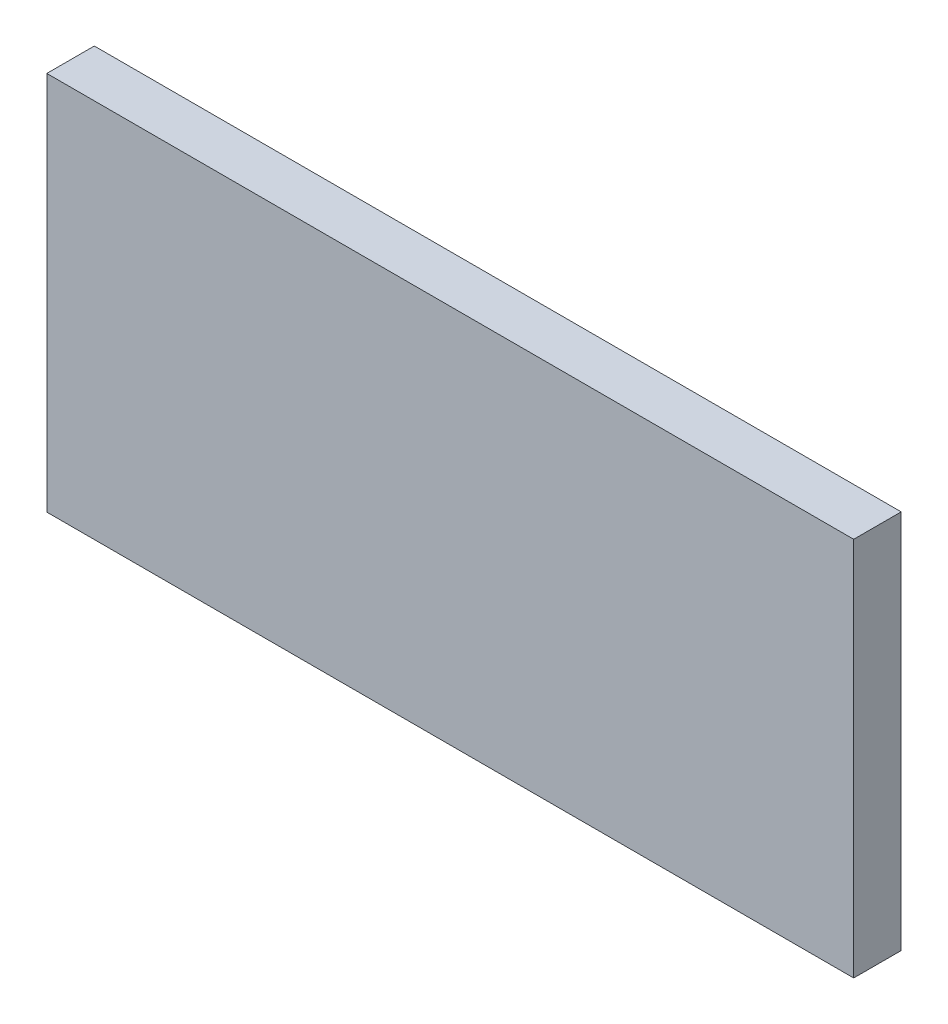
ISO-10303-21;
HEADER;
FILE_DESCRIPTION(('STEP AP214'),'2;1');
FILE_NAME('part.step','',(''),(''),'','','');
FILE_SCHEMA(('AUTOMOTIVE_DESIGN { 1 0 10303 214 1 1 1 1 }'));
ENDSEC;
DATA;
#1=APPLICATION_CONTEXT('core data for automotive mechanical design processes');
#2=APPLICATION_PROTOCOL_DEFINITION('international standard','automotive_design',2000,#1);
#3=PRODUCT_CONTEXT('',#1,'mechanical');
#4=PRODUCT('Part','Part','',(#3));
#5=PRODUCT_RELATED_PRODUCT_CATEGORY('part','',(#4));
#6=PRODUCT_DEFINITION_FORMATION('','',#4);
#7=PRODUCT_DEFINITION_CONTEXT('part definition',#1,'design');
#8=PRODUCT_DEFINITION('design','',#6,#7);
#9=PRODUCT_DEFINITION_SHAPE('','',#8);
#10=(LENGTH_UNIT() NAMED_UNIT(*) SI_UNIT(.MILLI.,.METRE.));
#11=(NAMED_UNIT(*) PLANE_ANGLE_UNIT() SI_UNIT($,.RADIAN.));
#12=(NAMED_UNIT(*) SI_UNIT($,.STERADIAN.) SOLID_ANGLE_UNIT());
#13=UNCERTAINTY_MEASURE_WITH_UNIT(LENGTH_MEASURE(1.E-05),#10,'distance_accuracy_value','');
#14=(GEOMETRIC_REPRESENTATION_CONTEXT(3) GLOBAL_UNCERTAINTY_ASSIGNED_CONTEXT((#13)) GLOBAL_UNIT_ASSIGNED_CONTEXT((#10,
#11,#12)) REPRESENTATION_CONTEXT('',''));
#15=CARTESIAN_POINT('',(0.,0.,0.));
#16=DIRECTION('',(0.,0.,1.));
#17=DIRECTION('',(1.,0.,0.));
#18=AXIS2_PLACEMENT_3D('',#15,#16,#17);
#19=CARTESIAN_POINT('',(-42.1247855345764,13.2792676056338,5.));
#20=DIRECTION('',(1.,0.,0.));
#21=DIRECTION('',(0.,0.,-1.));
#22=AXIS2_PLACEMENT_3D('',#19,#20,#21);
#23=PLANE('',#22);
#24=DIRECTION('',(0.,-1.,0.));
#25=VECTOR('',#24,1.);
#26=CARTESIAN_POINT('',(-42.1247855345764,13.2792676056338,0.));
#27=LINE('',#26,#25);
#28=CARTESIAN_POINT('',(-42.1247855345764,13.2792676056338,0.));
#29=VERTEX_POINT('',#28);
#30=CARTESIAN_POINT('',(-42.1247855345764,-26.7207323943662,0.));
#31=VERTEX_POINT('',#30);
#32=EDGE_CURVE('E98',#29,#31,#27,.T.);
#33=ORIENTED_EDGE('',*,*,#32,.T.);
#34=DIRECTION('',(0.,0.,-1.));
#35=VECTOR('',#34,1.);
#36=CARTESIAN_POINT('',(-42.1247855345764,-26.7207323943662,5.));
#37=LINE('',#36,#35);
#38=CARTESIAN_POINT('',(-42.1247855345764,-26.7207323943662,5.));
#39=VERTEX_POINT('',#38);
#40=EDGE_CURVE('E11',#39,#31,#37,.T.);
#41=ORIENTED_EDGE('',*,*,#40,.F.);
#42=DIRECTION('',(0.,-1.,0.));
#43=VECTOR('',#42,1.);
#44=CARTESIAN_POINT('',(-42.1247855345764,13.2792676056338,5.));
#45=LINE('',#44,#43);
#46=CARTESIAN_POINT('',(-42.1247855345764,13.2792676056338,5.));
#47=VERTEX_POINT('',#46);
#48=EDGE_CURVE('E86',#47,#39,#45,.T.);
#49=ORIENTED_EDGE('',*,*,#48,.F.);
#50=DIRECTION('',(0.,0.,-1.));
#51=VECTOR('',#50,1.);
#52=CARTESIAN_POINT('',(-42.1247855345764,13.2792676056338,5.));
#53=LINE('',#52,#51);
#54=EDGE_CURVE('E94',#47,#29,#53,.T.);
#55=ORIENTED_EDGE('',*,*,#54,.T.);
#56=EDGE_LOOP('',(#33,#41,#49,#55));
#57=FACE_BOUND('',#56,.T.);
#58=ADVANCED_FACE('F35',(#57),#23,.F.);
#59=CARTESIAN_POINT('',(-42.1247855345764,-26.7207323943662,5.));
#60=DIRECTION('',(0.,1.,0.));
#61=DIRECTION('',(0.,0.,1.));
#62=AXIS2_PLACEMENT_3D('',#59,#60,#61);
#63=PLANE('',#62);
#64=DIRECTION('',(1.,0.,0.));
#65=VECTOR('',#64,1.);
#66=CARTESIAN_POINT('',(-42.1247855345764,-26.7207323943662,0.));
#67=LINE('',#66,#65);
#68=CARTESIAN_POINT('',(42.8232144654236,-26.7207323943662,0.));
#69=VERTEX_POINT('',#68);
#70=EDGE_CURVE('E90',#31,#69,#67,.T.);
#71=ORIENTED_EDGE('',*,*,#70,.T.);
#72=DIRECTION('',(0.,0.,-1.));
#73=VECTOR('',#72,1.);
#74=CARTESIAN_POINT('',(42.8232144654236,-26.7207323943662,5.));
#75=LINE('',#74,#73);
#76=CARTESIAN_POINT('',(42.8232144654236,-26.7207323943662,5.));
#77=VERTEX_POINT('',#76);
#78=EDGE_CURVE('E43',#77,#69,#75,.T.);
#79=ORIENTED_EDGE('',*,*,#78,.F.);
#80=DIRECTION('',(1.,0.,0.));
#81=VECTOR('',#80,1.);
#82=CARTESIAN_POINT('',(-42.1247855345764,-26.7207323943662,5.));
#83=LINE('',#82,#81);
#84=EDGE_CURVE('E81',#39,#77,#83,.T.);
#85=ORIENTED_EDGE('',*,*,#84,.F.);
#86=ORIENTED_EDGE('',*,*,#40,.T.);
#87=EDGE_LOOP('',(#71,#79,#85,#86));
#88=FACE_BOUND('',#87,.T.);
#89=ADVANCED_FACE('F89',(#88),#63,.F.);
#90=CARTESIAN_POINT('',(42.8232144654236,13.2792676056338,5.));
#91=DIRECTION('',(-1.,0.,0.));
#92=DIRECTION('',(0.,0.,1.));
#93=AXIS2_PLACEMENT_3D('',#90,#91,#92);
#94=PLANE('',#93);
#95=DIRECTION('',(0.,1.,0.));
#96=VECTOR('',#95,1.);
#97=CARTESIAN_POINT('',(42.8232144654236,13.2792676056338,0.));
#98=LINE('',#97,#96);
#99=CARTESIAN_POINT('',(42.8232144654236,13.2792676056338,0.));
#100=VERTEX_POINT('',#99);
#101=EDGE_CURVE('E68',#69,#100,#98,.T.);
#102=ORIENTED_EDGE('',*,*,#101,.T.);
#103=DIRECTION('',(0.,0.,-1.));
#104=VECTOR('',#103,1.);
#105=CARTESIAN_POINT('',(42.8232144654236,13.2792676056338,5.));
#106=LINE('',#105,#104);
#107=CARTESIAN_POINT('',(42.8232144654236,13.2792676056338,5.));
#108=VERTEX_POINT('',#107);
#109=EDGE_CURVE('E91',#108,#100,#106,.T.);
#110=ORIENTED_EDGE('',*,*,#109,.F.);
#111=DIRECTION('',(0.,1.,0.));
#112=VECTOR('',#111,1.);
#113=CARTESIAN_POINT('',(42.8232144654236,13.2792676056338,5.));
#114=LINE('',#113,#112);
#115=EDGE_CURVE('E84',#77,#108,#114,.T.);
#116=ORIENTED_EDGE('',*,*,#115,.F.);
#117=ORIENTED_EDGE('',*,*,#78,.T.);
#118=EDGE_LOOP('',(#102,#110,#116,#117));
#119=FACE_BOUND('',#118,.T.);
#120=ADVANCED_FACE('F92',(#119),#94,.F.);
#121=CARTESIAN_POINT('',(-42.1247855345764,13.2792676056338,5.));
#122=DIRECTION('',(0.,-1.,0.));
#123=DIRECTION('',(0.,0.,-1.));
#124=AXIS2_PLACEMENT_3D('',#121,#122,#123);
#125=PLANE('',#124);
#126=DIRECTION('',(-1.,0.,0.));
#127=VECTOR('',#126,1.);
#128=CARTESIAN_POINT('',(-42.1247855345764,13.2792676056338,0.));
#129=LINE('',#128,#127);
#130=EDGE_CURVE('E74',#100,#29,#129,.T.);
#131=ORIENTED_EDGE('',*,*,#130,.T.);
#132=ORIENTED_EDGE('',*,*,#54,.F.);
#133=DIRECTION('',(-1.,0.,0.));
#134=VECTOR('',#133,1.);
#135=CARTESIAN_POINT('',(-42.1247855345764,13.2792676056338,5.));
#136=LINE('',#135,#134);
#137=EDGE_CURVE('E51',#108,#47,#136,.T.);
#138=ORIENTED_EDGE('',*,*,#137,.F.);
#139=ORIENTED_EDGE('',*,*,#109,.T.);
#140=EDGE_LOOP('',(#131,#132,#138,#139));
#141=FACE_BOUND('',#140,.T.);
#142=ADVANCED_FACE('F105',(#141),#125,.F.);
#143=CARTESIAN_POINT('',(0.,0.,5.));
#144=DIRECTION('',(0.,0.,1.));
#145=DIRECTION('',(1.,0.,0.));
#146=AXIS2_PLACEMENT_3D('',#143,#144,#145);
#147=PLANE('',#146);
#148=ORIENTED_EDGE('',*,*,#48,.T.);
#149=ORIENTED_EDGE('',*,*,#84,.T.);
#150=ORIENTED_EDGE('',*,*,#115,.T.);
#151=ORIENTED_EDGE('',*,*,#137,.T.);
#152=EDGE_LOOP('',(#148,#149,#150,#151));
#153=FACE_BOUND('',#152,.T.);
#154=ADVANCED_FACE('F82',(#153),#147,.T.);
#155=CARTESIAN_POINT('',(0.,0.,0.));
#156=DIRECTION('',(0.,0.,1.));
#157=DIRECTION('',(1.,0.,0.));
#158=AXIS2_PLACEMENT_3D('',#155,#156,#157);
#159=PLANE('',#158);
#160=ORIENTED_EDGE('',*,*,#32,.F.);
#161=ORIENTED_EDGE('',*,*,#130,.F.);
#162=ORIENTED_EDGE('',*,*,#101,.F.);
#163=ORIENTED_EDGE('',*,*,#70,.F.);
#164=EDGE_LOOP('',(#160,#161,#162,#163));
#165=FACE_BOUND('',#164,.T.);
#166=ADVANCED_FACE('F108',(#165),#159,.F.);
#167=CLOSED_SHELL('',(#58,#89,#120,#142,#154,#166));
#168=MANIFOLD_SOLID_BREP('B2',#167);
#169=ADVANCED_BREP_SHAPE_REPRESENTATION('',(#18,#168),#14);
#170=SHAPE_DEFINITION_REPRESENTATION(#9,#169);
ENDSEC;
END-ISO-10303-21;
